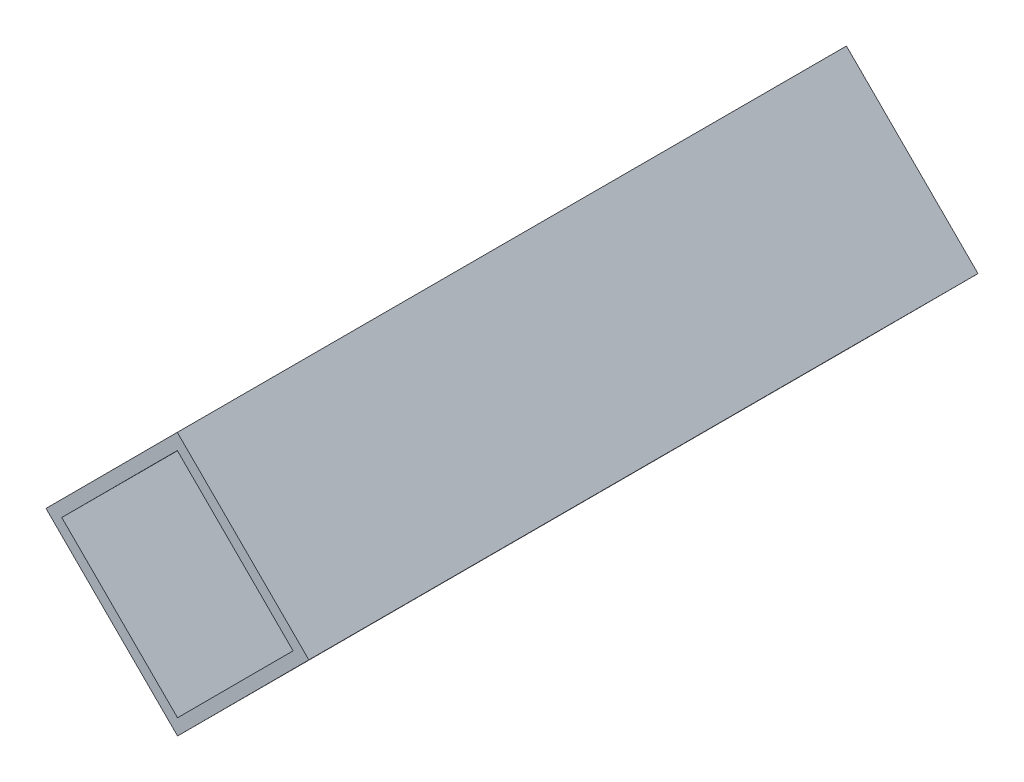
ISO-10303-21;
HEADER;
FILE_DESCRIPTION(('STEP AP214'),'2;1');
FILE_NAME('part.step','',(''),(''),'','','');
FILE_SCHEMA(('AUTOMOTIVE_DESIGN { 1 0 10303 214 1 1 1 1 }'));
ENDSEC;
DATA;
#1=APPLICATION_CONTEXT('core data for automotive mechanical design processes');
#2=APPLICATION_PROTOCOL_DEFINITION('international standard','automotive_design',2000,#1);
#3=PRODUCT_CONTEXT('',#1,'mechanical');
#4=PRODUCT('Part','Part','',(#3));
#5=PRODUCT_RELATED_PRODUCT_CATEGORY('part','',(#4));
#6=PRODUCT_DEFINITION_FORMATION('','',#4);
#7=PRODUCT_DEFINITION_CONTEXT('part definition',#1,'design');
#8=PRODUCT_DEFINITION('design','',#6,#7);
#9=PRODUCT_DEFINITION_SHAPE('','',#8);
#10=(LENGTH_UNIT() NAMED_UNIT(*) SI_UNIT(.MILLI.,.METRE.));
#11=(NAMED_UNIT(*) PLANE_ANGLE_UNIT() SI_UNIT($,.RADIAN.));
#12=(NAMED_UNIT(*) SI_UNIT($,.STERADIAN.) SOLID_ANGLE_UNIT());
#13=UNCERTAINTY_MEASURE_WITH_UNIT(LENGTH_MEASURE(1.E-05),#10,'distance_accuracy_value','');
#14=(GEOMETRIC_REPRESENTATION_CONTEXT(3) GLOBAL_UNCERTAINTY_ASSIGNED_CONTEXT((#13)) GLOBAL_UNIT_ASSIGNED_CONTEXT((#10,
#11,#12)) REPRESENTATION_CONTEXT('',''));
#15=CARTESIAN_POINT('',(0.,0.,0.));
#16=DIRECTION('',(0.,0.,1.));
#17=DIRECTION('',(1.,0.,0.));
#18=AXIS2_PLACEMENT_3D('',#15,#16,#17);
#19=CARTESIAN_POINT('',(0.,0.,90.));
#20=DIRECTION('',(0.,0.,1.));
#21=DIRECTION('',(1.,0.,0.));
#22=AXIS2_PLACEMENT_3D('',#19,#20,#21);
#23=PLANE('',#22);
#24=DIRECTION('',(-0.70646122875546,-0.707751744798503,0.));
#25=VECTOR('',#24,1.);
#26=CARTESIAN_POINT('',(0.,0.,90.));
#27=LINE('',#26,#25);
#28=CARTESIAN_POINT('',(0.,0.,90.));
#29=VERTEX_POINT('',#28);
#30=CARTESIAN_POINT('',(-17.6615307188865,-17.6937936199626,90.));
#31=VERTEX_POINT('',#30);
#32=EDGE_CURVE('E137',#29,#31,#27,.T.);
#33=ORIENTED_EDGE('',*,*,#32,.T.);
#34=DIRECTION('',(0.707751744798503,-0.70646122875546,0.));
#35=VECTOR('',#34,1.);
#36=CARTESIAN_POINT('',(-17.6615307188865,-17.6937936199626,90.));
#37=LINE('',#36,#35);
#38=CARTESIAN_POINT('',(0.0322629010760627,-35.3553243388491,90.));
#39=VERTEX_POINT('',#38);
#40=EDGE_CURVE('E140',#31,#39,#37,.T.);
#41=ORIENTED_EDGE('',*,*,#40,.T.);
#42=DIRECTION('',(0.70646122875546,0.707751744798503,0.));
#43=VECTOR('',#42,1.);
#44=CARTESIAN_POINT('',(17.6937936199626,-17.6615307188865,90.));
#45=LINE('',#44,#43);
#46=CARTESIAN_POINT('',(17.6937936199626,-17.6615307188865,90.));
#47=VERTEX_POINT('',#46);
#48=EDGE_CURVE('E143',#39,#47,#45,.T.);
#49=ORIENTED_EDGE('',*,*,#48,.T.);
#50=DIRECTION('',(-0.707751744798503,0.70646122875546,0.));
#51=VECTOR('',#50,1.);
#52=CARTESIAN_POINT('',(0.,0.,90.));
#53=LINE('',#52,#51);
#54=EDGE_CURVE('E145',#47,#29,#53,.T.);
#55=ORIENTED_EDGE('',*,*,#54,.T.);
#56=EDGE_LOOP('',(#33,#41,#49,#55));
#57=FACE_BOUND('',#56,.T.);
#58=DIRECTION('',(-0.706461228755461,-0.707751744798503,0.));
#59=VECTOR('',#58,1.);
#60=CARTESIAN_POINT('',(0.00193577406456353,-2.12131946033095,90.));
#61=LINE('',#60,#59);
#62=CARTESIAN_POINT('',(0.00193577406456353,-2.12131946033095,90.));
#63=VERTEX_POINT('',#62);
#64=CARTESIAN_POINT('',(-15.5402112585556,-17.691857845898,90.));
#65=VERTEX_POINT('',#64);
#66=EDGE_CURVE('E109',#63,#65,#61,.T.);
#67=ORIENTED_EDGE('',*,*,#66,.F.);
#68=DIRECTION('',(-0.707751744798503,0.70646122875546,0.));
#69=VECTOR('',#68,1.);
#70=CARTESIAN_POINT('',(0.00193577406456353,-2.12131946033095,90.));
#71=LINE('',#70,#69);
#72=CARTESIAN_POINT('',(15.5724741596316,-17.6634664929511,90.));
#73=VERTEX_POINT('',#72);
#74=EDGE_CURVE('E101',#73,#63,#71,.T.);
#75=ORIENTED_EDGE('',*,*,#74,.F.);
#76=DIRECTION('',(0.70646122875546,0.707751744798503,0.));
#77=VECTOR('',#76,1.);
#78=CARTESIAN_POINT('',(15.5724741596316,-17.6634664929511,90.));
#79=LINE('',#78,#77);
#80=CARTESIAN_POINT('',(0.0303271270114917,-33.2340048785181,90.));
#81=VERTEX_POINT('',#80);
#82=EDGE_CURVE('E123',#81,#73,#79,.T.);
#83=ORIENTED_EDGE('',*,*,#82,.F.);
#84=DIRECTION('',(0.707751744798503,-0.70646122875546,0.));
#85=VECTOR('',#84,1.);
#86=CARTESIAN_POINT('',(-15.5402112585556,-17.691857845898,90.));
#87=LINE('',#86,#85);
#88=EDGE_CURVE('E121',#65,#81,#87,.T.);
#89=ORIENTED_EDGE('',*,*,#88,.F.);
#90=EDGE_LOOP('',(#67,#75,#83,#89));
#91=FACE_BOUND('',#90,.T.);
#92=ADVANCED_FACE('F36',(#57,#91),#23,.T.);
#93=CARTESIAN_POINT('',(0.,0.,0.));
#94=DIRECTION('',(0.,0.,1.));
#95=DIRECTION('',(1.,0.,0.));
#96=AXIS2_PLACEMENT_3D('',#93,#94,#95);
#97=PLANE('',#96);
#98=DIRECTION('',(-0.70646122875546,-0.707751744798503,0.));
#99=VECTOR('',#98,1.);
#100=CARTESIAN_POINT('',(0.,0.,0.));
#101=LINE('',#100,#99);
#102=CARTESIAN_POINT('',(0.,0.,0.));
#103=VERTEX_POINT('',#102);
#104=CARTESIAN_POINT('',(-17.6615307188865,-17.6937936199626,0.));
#105=VERTEX_POINT('',#104);
#106=EDGE_CURVE('E117',#103,#105,#101,.T.);
#107=ORIENTED_EDGE('',*,*,#106,.F.);
#108=DIRECTION('',(-0.707751744798503,0.70646122875546,0.));
#109=VECTOR('',#108,1.);
#110=CARTESIAN_POINT('',(0.,0.,0.));
#111=LINE('',#110,#109);
#112=CARTESIAN_POINT('',(17.6937936199626,-17.6615307188865,0.));
#113=VERTEX_POINT('',#112);
#114=EDGE_CURVE('E141',#113,#103,#111,.T.);
#115=ORIENTED_EDGE('',*,*,#114,.F.);
#116=DIRECTION('',(0.70646122875546,0.707751744798503,0.));
#117=VECTOR('',#116,1.);
#118=CARTESIAN_POINT('',(17.6937936199626,-17.6615307188865,0.));
#119=LINE('',#118,#117);
#120=CARTESIAN_POINT('',(0.0322629010760627,-35.3553243388491,0.));
#121=VERTEX_POINT('',#120);
#122=EDGE_CURVE('E152',#121,#113,#119,.T.);
#123=ORIENTED_EDGE('',*,*,#122,.F.);
#124=DIRECTION('',(0.707751744798503,-0.70646122875546,0.));
#125=VECTOR('',#124,1.);
#126=CARTESIAN_POINT('',(-17.6615307188865,-17.6937936199626,0.));
#127=LINE('',#126,#125);
#128=EDGE_CURVE('E150',#105,#121,#127,.T.);
#129=ORIENTED_EDGE('',*,*,#128,.F.);
#130=EDGE_LOOP('',(#107,#115,#123,#129));
#131=FACE_BOUND('',#130,.T.);
#132=DIRECTION('',(-0.707751744798503,0.70646122875546,0.));
#133=VECTOR('',#132,1.);
#134=CARTESIAN_POINT('',(0.00193577406456353,-2.12131946033095,0.));
#135=LINE('',#134,#133);
#136=CARTESIAN_POINT('',(15.5724741596316,-17.6634664929511,0.));
#137=VERTEX_POINT('',#136);
#138=CARTESIAN_POINT('',(0.00193577406456353,-2.12131946033095,0.));
#139=VERTEX_POINT('',#138);
#140=EDGE_CURVE('E59',#137,#139,#135,.T.);
#141=ORIENTED_EDGE('',*,*,#140,.T.);
#142=DIRECTION('',(-0.706461228755461,-0.707751744798503,0.));
#143=VECTOR('',#142,1.);
#144=CARTESIAN_POINT('',(0.00193577406456353,-2.12131946033095,0.));
#145=LINE('',#144,#143);
#146=CARTESIAN_POINT('',(-15.5402112585556,-17.691857845898,0.));
#147=VERTEX_POINT('',#146);
#148=EDGE_CURVE('E116',#139,#147,#145,.T.);
#149=ORIENTED_EDGE('',*,*,#148,.T.);
#150=DIRECTION('',(0.707751744798503,-0.70646122875546,0.));
#151=VECTOR('',#150,1.);
#152=CARTESIAN_POINT('',(-15.5402112585556,-17.691857845898,0.));
#153=LINE('',#152,#151);
#154=CARTESIAN_POINT('',(0.0303271270114987,-33.2340048785181,0.));
#155=VERTEX_POINT('',#154);
#156=EDGE_CURVE('E129',#147,#155,#153,.T.);
#157=ORIENTED_EDGE('',*,*,#156,.T.);
#158=DIRECTION('',(0.70646122875546,0.707751744798503,0.));
#159=VECTOR('',#158,1.);
#160=CARTESIAN_POINT('',(15.5724741596316,-17.6634664929511,0.));
#161=LINE('',#160,#159);
#162=EDGE_CURVE('E110',#155,#137,#161,.T.);
#163=ORIENTED_EDGE('',*,*,#162,.T.);
#164=EDGE_LOOP('',(#141,#149,#157,#163));
#165=FACE_BOUND('',#164,.T.);
#166=ADVANCED_FACE('F170',(#131,#165),#97,.F.);
#167=CARTESIAN_POINT('',(0.,0.,90.));
#168=DIRECTION('',(0.707751744798503,-0.70646122875546,0.));
#169=DIRECTION('',(0.70646122875546,0.707751744798503,0.));
#170=AXIS2_PLACEMENT_3D('',#167,#168,#169);
#171=PLANE('',#170);
#172=ORIENTED_EDGE('',*,*,#106,.T.);
#173=DIRECTION('',(0.,0.,-1.));
#174=VECTOR('',#173,1.);
#175=CARTESIAN_POINT('',(-17.6615307188865,-17.6937936199626,90.));
#176=LINE('',#175,#174);
#177=EDGE_CURVE('E11',#31,#105,#176,.T.);
#178=ORIENTED_EDGE('',*,*,#177,.F.);
#179=ORIENTED_EDGE('',*,*,#32,.F.);
#180=DIRECTION('',(0.,0.,-1.));
#181=VECTOR('',#180,1.);
#182=CARTESIAN_POINT('',(0.,0.,90.));
#183=LINE('',#182,#181);
#184=EDGE_CURVE('E147',#29,#103,#183,.T.);
#185=ORIENTED_EDGE('',*,*,#184,.T.);
#186=EDGE_LOOP('',(#172,#178,#179,#185));
#187=FACE_BOUND('',#186,.T.);
#188=ADVANCED_FACE('F38',(#187),#171,.F.);
#189=CARTESIAN_POINT('',(-17.6615307188865,-17.6937936199626,90.));
#190=DIRECTION('',(0.70646122875546,0.707751744798503,0.));
#191=DIRECTION('',(-0.707751744798503,0.70646122875546,0.));
#192=AXIS2_PLACEMENT_3D('',#189,#190,#191);
#193=PLANE('',#192);
#194=ORIENTED_EDGE('',*,*,#128,.T.);
#195=DIRECTION('',(0.,0.,-1.));
#196=VECTOR('',#195,1.);
#197=CARTESIAN_POINT('',(0.0322629010760627,-35.3553243388491,90.));
#198=LINE('',#197,#196);
#199=EDGE_CURVE('E44',#39,#121,#198,.T.);
#200=ORIENTED_EDGE('',*,*,#199,.F.);
#201=ORIENTED_EDGE('',*,*,#40,.F.);
#202=ORIENTED_EDGE('',*,*,#177,.T.);
#203=EDGE_LOOP('',(#194,#200,#201,#202));
#204=FACE_BOUND('',#203,.T.);
#205=ADVANCED_FACE('F180',(#204),#193,.F.);
#206=CARTESIAN_POINT('',(17.6937936199626,-17.6615307188865,90.));
#207=DIRECTION('',(-0.707751744798503,0.70646122875546,0.));
#208=DIRECTION('',(-0.70646122875546,-0.707751744798503,0.));
#209=AXIS2_PLACEMENT_3D('',#206,#207,#208);
#210=PLANE('',#209);
#211=ORIENTED_EDGE('',*,*,#122,.T.);
#212=DIRECTION('',(0.,0.,-1.));
#213=VECTOR('',#212,1.);
#214=CARTESIAN_POINT('',(17.6937936199626,-17.6615307188865,90.));
#215=LINE('',#214,#213);
#216=EDGE_CURVE('E157',#47,#113,#215,.T.);
#217=ORIENTED_EDGE('',*,*,#216,.F.);
#218=ORIENTED_EDGE('',*,*,#48,.F.);
#219=ORIENTED_EDGE('',*,*,#199,.T.);
#220=EDGE_LOOP('',(#211,#217,#218,#219));
#221=FACE_BOUND('',#220,.T.);
#222=ADVANCED_FACE('F164',(#221),#210,.F.);
#223=CARTESIAN_POINT('',(0.,0.,90.));
#224=DIRECTION('',(-0.70646122875546,-0.707751744798503,0.));
#225=DIRECTION('',(0.707751744798503,-0.70646122875546,0.));
#226=AXIS2_PLACEMENT_3D('',#223,#224,#225);
#227=PLANE('',#226);
#228=ORIENTED_EDGE('',*,*,#114,.T.);
#229=ORIENTED_EDGE('',*,*,#184,.F.);
#230=ORIENTED_EDGE('',*,*,#54,.F.);
#231=ORIENTED_EDGE('',*,*,#216,.T.);
#232=EDGE_LOOP('',(#228,#229,#230,#231));
#233=FACE_BOUND('',#232,.T.);
#234=ADVANCED_FACE('F174',(#233),#227,.F.);
#235=CARTESIAN_POINT('',(0.00193577406456353,-2.12131946033095,90.));
#236=DIRECTION('',(-0.70646122875546,-0.707751744798503,0.));
#237=DIRECTION('',(0.707751744798503,-0.70646122875546,0.));
#238=AXIS2_PLACEMENT_3D('',#235,#236,#237);
#239=PLANE('',#238);
#240=ORIENTED_EDGE('',*,*,#140,.F.);
#241=DIRECTION('',(0.,0.,-1.));
#242=VECTOR('',#241,1.);
#243=CARTESIAN_POINT('',(15.5724741596316,-17.6634664929511,90.));
#244=LINE('',#243,#242);
#245=EDGE_CURVE('E105',#73,#137,#244,.T.);
#246=ORIENTED_EDGE('',*,*,#245,.F.);
#247=ORIENTED_EDGE('',*,*,#74,.T.);
#248=DIRECTION('',(0.,0.,-1.));
#249=VECTOR('',#248,1.);
#250=CARTESIAN_POINT('',(0.00193577406456353,-2.12131946033095,90.));
#251=LINE('',#250,#249);
#252=EDGE_CURVE('E104',#63,#139,#251,.T.);
#253=ORIENTED_EDGE('',*,*,#252,.T.);
#254=EDGE_LOOP('',(#240,#246,#247,#253));
#255=FACE_BOUND('',#254,.T.);
#256=ADVANCED_FACE('F103',(#255),#239,.T.);
#257=CARTESIAN_POINT('',(0.00193577406456353,-2.12131946033095,90.));
#258=DIRECTION('',(0.707751744798503,-0.70646122875546,0.));
#259=DIRECTION('',(0.706461228755461,0.707751744798503,0.));
#260=AXIS2_PLACEMENT_3D('',#257,#258,#259);
#261=PLANE('',#260);
#262=ORIENTED_EDGE('',*,*,#148,.F.);
#263=ORIENTED_EDGE('',*,*,#252,.F.);
#264=ORIENTED_EDGE('',*,*,#66,.T.);
#265=DIRECTION('',(0.,0.,-1.));
#266=VECTOR('',#265,1.);
#267=CARTESIAN_POINT('',(-15.5402112585556,-17.691857845898,90.));
#268=LINE('',#267,#266);
#269=EDGE_CURVE('E118',#65,#147,#268,.T.);
#270=ORIENTED_EDGE('',*,*,#269,.T.);
#271=EDGE_LOOP('',(#262,#263,#264,#270));
#272=FACE_BOUND('',#271,.T.);
#273=ADVANCED_FACE('F113',(#272),#261,.T.);
#274=CARTESIAN_POINT('',(-15.5402112585556,-17.691857845898,90.));
#275=DIRECTION('',(0.70646122875546,0.707751744798503,0.));
#276=DIRECTION('',(-0.707751744798503,0.70646122875546,0.));
#277=AXIS2_PLACEMENT_3D('',#274,#275,#276);
#278=PLANE('',#277);
#279=ORIENTED_EDGE('',*,*,#156,.F.);
#280=ORIENTED_EDGE('',*,*,#269,.F.);
#281=ORIENTED_EDGE('',*,*,#88,.T.);
#282=DIRECTION('',(0.,0.,-1.));
#283=VECTOR('',#282,1.);
#284=CARTESIAN_POINT('',(0.0303271270114987,-33.2340048785181,90.));
#285=LINE('',#284,#283);
#286=EDGE_CURVE('E51',#81,#155,#285,.T.);
#287=ORIENTED_EDGE('',*,*,#286,.T.);
#288=EDGE_LOOP('',(#279,#280,#281,#287));
#289=FACE_BOUND('',#288,.T.);
#290=ADVANCED_FACE('F203',(#289),#278,.T.);
#291=CARTESIAN_POINT('',(15.5724741596316,-17.6634664929511,90.));
#292=DIRECTION('',(-0.707751744798503,0.70646122875546,0.));
#293=DIRECTION('',(-0.70646122875546,-0.707751744798503,0.));
#294=AXIS2_PLACEMENT_3D('',#291,#292,#293);
#295=PLANE('',#294);
#296=ORIENTED_EDGE('',*,*,#162,.F.);
#297=ORIENTED_EDGE('',*,*,#286,.F.);
#298=ORIENTED_EDGE('',*,*,#82,.T.);
#299=ORIENTED_EDGE('',*,*,#245,.T.);
#300=EDGE_LOOP('',(#296,#297,#298,#299));
#301=FACE_BOUND('',#300,.T.);
#302=ADVANCED_FACE('F207',(#301),#295,.T.);
#303=CLOSED_SHELL('',(#92,#166,#188,#205,#222,#234,#256,#273,#290,#302));
#304=MANIFOLD_SOLID_BREP('B2',#303);
#305=ADVANCED_BREP_SHAPE_REPRESENTATION('',(#18,#304),#14);
#306=SHAPE_DEFINITION_REPRESENTATION(#9,#305);
ENDSEC;
END-ISO-10303-21;
